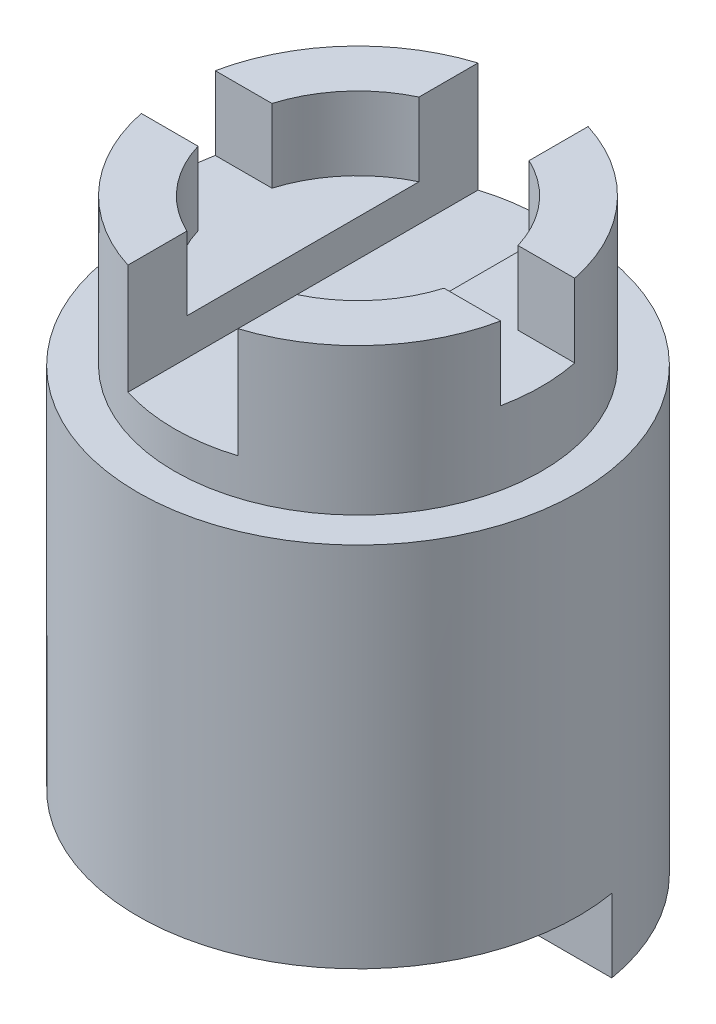
ISO-10303-21;
HEADER;
FILE_DESCRIPTION(('STEP AP214'),'2;1');
FILE_NAME('part.step','',(''),(''),'','','');
FILE_SCHEMA(('AUTOMOTIVE_DESIGN { 1 0 10303 214 1 1 1 1 }'));
ENDSEC;
DATA;
#1=APPLICATION_CONTEXT('core data for automotive mechanical design processes');
#2=APPLICATION_PROTOCOL_DEFINITION('international standard','automotive_design',2000,#1);
#3=PRODUCT_CONTEXT('',#1,'mechanical');
#4=PRODUCT('Part','Part','',(#3));
#5=PRODUCT_RELATED_PRODUCT_CATEGORY('part','',(#4));
#6=PRODUCT_DEFINITION_FORMATION('','',#4);
#7=PRODUCT_DEFINITION_CONTEXT('part definition',#1,'design');
#8=PRODUCT_DEFINITION('design','',#6,#7);
#9=PRODUCT_DEFINITION_SHAPE('','',#8);
#10=(LENGTH_UNIT() NAMED_UNIT(*) SI_UNIT(.MILLI.,.METRE.));
#11=(NAMED_UNIT(*) PLANE_ANGLE_UNIT() SI_UNIT($,.RADIAN.));
#12=(NAMED_UNIT(*) SI_UNIT($,.STERADIAN.) SOLID_ANGLE_UNIT());
#13=UNCERTAINTY_MEASURE_WITH_UNIT(LENGTH_MEASURE(1.E-05),#10,'distance_accuracy_value','');
#14=(GEOMETRIC_REPRESENTATION_CONTEXT(3) GLOBAL_UNCERTAINTY_ASSIGNED_CONTEXT((#13)) GLOBAL_UNIT_ASSIGNED_CONTEXT((#10,
#11,#12)) REPRESENTATION_CONTEXT('',''));
#15=CARTESIAN_POINT('',(0.,0.,0.));
#16=DIRECTION('',(0.,0.,1.));
#17=DIRECTION('',(1.,0.,0.));
#18=AXIS2_PLACEMENT_3D('',#15,#16,#17);
#19=CARTESIAN_POINT('',(0.,0.,0.));
#20=DIRECTION('',(0.,1.,0.));
#21=DIRECTION('',(0.,0.,1.));
#22=AXIS2_PLACEMENT_3D('',#19,#20,#21);
#23=PLANE('',#22);
#24=CARTESIAN_POINT('',(0.,0.,0.));
#25=DIRECTION('',(0.,1.,0.));
#26=DIRECTION('',(0.,0.,1.));
#27=AXIS2_PLACEMENT_3D('',#24,#25,#26);
#28=CIRCLE('',#27,19.05);
#29=CARTESIAN_POINT('',(18.7835533113413,0.,-3.175));
#30=VERTEX_POINT('',#29);
#31=CARTESIAN_POINT('',(3.2004,0.,-18.7792422594736));
#32=VERTEX_POINT('',#31);
#33=EDGE_CURVE('E244',#30,#32,#28,.T.);
#34=ORIENTED_EDGE('',*,*,#33,.F.);
#35=DIRECTION('',(1.,0.,0.));
#36=VECTOR('',#35,1.);
#37=CARTESIAN_POINT('',(-19.05,0.,-3.175));
#38=LINE('',#37,#36);
#39=CARTESIAN_POINT('',(8.98025612106915,0.,-3.175));
#40=VERTEX_POINT('',#39);
#41=EDGE_CURVE('E236',#40,#30,#38,.T.);
#42=ORIENTED_EDGE('',*,*,#41,.F.);
#43=CARTESIAN_POINT('',(0.,0.,0.));
#44=DIRECTION('',(0.,-1.,0.));
#45=DIRECTION('',(0.,0.,-1.));
#46=AXIS2_PLACEMENT_3D('',#43,#44,#45);
#47=CIRCLE('',#46,9.525);
#48=CARTESIAN_POINT('',(3.2004,0.,-8.97123541325274));
#49=VERTEX_POINT('',#48);
#50=EDGE_CURVE('E416',#49,#40,#47,.T.);
#51=ORIENTED_EDGE('',*,*,#50,.F.);
#52=DIRECTION('',(0.,0.,1.));
#53=VECTOR('',#52,1.);
#54=CARTESIAN_POINT('',(3.2004,0.,0.));
#55=LINE('',#54,#53);
#56=EDGE_CURVE('E440',#32,#49,#55,.T.);
#57=ORIENTED_EDGE('',*,*,#56,.F.);
#58=EDGE_LOOP('',(#34,#42,#51,#57));
#59=FACE_BOUND('',#58,.T.);
#60=ADVANCED_FACE('F55',(#59),#23,.F.);
#61=CARTESIAN_POINT('',(0.,6.35,0.));
#62=DIRECTION('',(0.,-1.,0.));
#63=DIRECTION('',(0.,0.,-1.));
#64=AXIS2_PLACEMENT_3D('',#61,#62,#63);
#65=CYLINDRICAL_SURFACE('',#64,9.525);
#66=ORIENTED_EDGE('',*,*,#50,.T.);
#67=DIRECTION('',(0.,-1.,0.));
#68=VECTOR('',#67,1.);
#69=CARTESIAN_POINT('',(8.98025612106915,6.35,-3.175));
#70=LINE('',#69,#68);
#71=CARTESIAN_POINT('',(8.98025612106915,6.35,-3.175));
#72=VERTEX_POINT('',#71);
#73=EDGE_CURVE('E225',#40,#72,#70,.F.);
#74=ORIENTED_EDGE('',*,*,#73,.T.);
#75=CARTESIAN_POINT('',(0.,6.35,0.));
#76=DIRECTION('',(0.,-1.,0.));
#77=DIRECTION('',(0.,0.,-1.));
#78=AXIS2_PLACEMENT_3D('',#75,#76,#77);
#79=CIRCLE('',#78,9.525);
#80=CARTESIAN_POINT('',(3.2004,6.35,-8.97123541325274));
#81=VERTEX_POINT('',#80);
#82=EDGE_CURVE('E407',#81,#72,#79,.T.);
#83=ORIENTED_EDGE('',*,*,#82,.F.);
#84=DIRECTION('',(0.,-1.,0.));
#85=VECTOR('',#84,1.);
#86=CARTESIAN_POINT('',(3.2004,6.35,-8.97123541325274));
#87=LINE('',#86,#85);
#88=EDGE_CURVE('E436',#81,#49,#87,.T.);
#89=ORIENTED_EDGE('',*,*,#88,.T.);
#90=EDGE_LOOP('',(#66,#74,#83,#89));
#91=FACE_BOUND('',#90,.T.);
#92=ADVANCED_FACE('F522',(#91),#65,.F.);
#93=CARTESIAN_POINT('',(0.,50.8,0.));
#94=DIRECTION('',(0.,1.,0.));
#95=DIRECTION('',(0.,0.,1.));
#96=AXIS2_PLACEMENT_3D('',#93,#94,#95);
#97=PLANE('',#96);
#98=DIRECTION('',(-1.,0.,0.));
#99=VECTOR('',#98,1.);
#100=CARTESIAN_POINT('',(-19.05,50.8,-3.2004));
#101=LINE('',#100,#99);
#102=CARTESIAN_POINT('',(-10.6416679186113,50.8,-3.2004));
#103=VERTEX_POINT('',#102);
#104=CARTESIAN_POINT('',(-15.5490535030271,50.8,-3.2004));
#105=VERTEX_POINT('',#104);
#106=EDGE_CURVE('E360',#103,#105,#101,.T.);
#107=ORIENTED_EDGE('',*,*,#106,.F.);
#108=CARTESIAN_POINT('',(0.,50.8,0.));
#109=DIRECTION('',(0.,1.,0.));
#110=DIRECTION('',(0.,0.,1.));
#111=AXIS2_PLACEMENT_3D('',#108,#109,#110);
#112=CIRCLE('',#111,11.1125);
#113=CARTESIAN_POINT('',(-4.7625,50.8,-10.0402315710346));
#114=VERTEX_POINT('',#113);
#115=EDGE_CURVE('E339',#114,#103,#112,.T.);
#116=ORIENTED_EDGE('',*,*,#115,.F.);
#117=DIRECTION('',(0.,0.,1.));
#118=VECTOR('',#117,1.);
#119=CARTESIAN_POINT('',(-4.76250000000001,50.8,-19.05));
#120=LINE('',#119,#118);
#121=CARTESIAN_POINT('',(-4.7625,50.8,-15.143784822494));
#122=VERTEX_POINT('',#121);
#123=EDGE_CURVE('E300',#122,#114,#120,.T.);
#124=ORIENTED_EDGE('',*,*,#123,.F.);
#125=CARTESIAN_POINT('',(0.,50.8,0.));
#126=DIRECTION('',(0.,1.,0.));
#127=DIRECTION('',(0.,0.,1.));
#128=AXIS2_PLACEMENT_3D('',#125,#126,#127);
#129=CIRCLE('',#128,15.875);
#130=EDGE_CURVE('E347',#122,#105,#129,.T.);
#131=ORIENTED_EDGE('',*,*,#130,.T.);
#132=EDGE_LOOP('',(#107,#116,#124,#131));
#133=FACE_BOUND('',#132,.T.);
#134=ADVANCED_FACE('F358',(#133),#97,.T.);
#135=CARTESIAN_POINT('',(0.,44.45,0.));
#136=DIRECTION('',(0.,1.,0.));
#137=DIRECTION('',(0.,0.,1.));
#138=AXIS2_PLACEMENT_3D('',#135,#136,#137);
#139=CYLINDRICAL_SURFACE('',#138,11.1125);
#140=ORIENTED_EDGE('',*,*,#115,.T.);
#141=DIRECTION('',(0.,1.,0.));
#142=VECTOR('',#141,1.);
#143=CARTESIAN_POINT('',(-10.6416679186113,44.45,-3.2004));
#144=LINE('',#143,#142);
#145=CARTESIAN_POINT('',(-10.6416679186113,44.45,-3.2004));
#146=VERTEX_POINT('',#145);
#147=EDGE_CURVE('E301',#103,#146,#144,.F.);
#148=ORIENTED_EDGE('',*,*,#147,.T.);
#149=CARTESIAN_POINT('',(0.,44.45,0.));
#150=DIRECTION('',(0.,1.,0.));
#151=DIRECTION('',(0.,0.,1.));
#152=AXIS2_PLACEMENT_3D('',#149,#150,#151);
#153=CIRCLE('',#152,11.1125);
#154=CARTESIAN_POINT('',(-4.7625,44.45,-10.0402315710346));
#155=VERTEX_POINT('',#154);
#156=EDGE_CURVE('E333',#155,#146,#153,.T.);
#157=ORIENTED_EDGE('',*,*,#156,.F.);
#158=DIRECTION('',(0.,1.,0.));
#159=VECTOR('',#158,1.);
#160=CARTESIAN_POINT('',(-4.7625,44.45,-10.0402315710346));
#161=LINE('',#160,#159);
#162=EDGE_CURVE('E312',#155,#114,#161,.T.);
#163=ORIENTED_EDGE('',*,*,#162,.T.);
#164=EDGE_LOOP('',(#140,#148,#157,#163));
#165=FACE_BOUND('',#164,.T.);
#166=ADVANCED_FACE('F560',(#165),#139,.F.);
#167=CARTESIAN_POINT('',(15.5490535030271,50.8,-3.2004));
#168=VERTEX_POINT('',#167);
#169=CARTESIAN_POINT('',(10.6416679186113,50.8,-3.2004));
#170=VERTEX_POINT('',#169);
#171=EDGE_CURVE('E402',#168,#170,#101,.T.);
#172=ORIENTED_EDGE('',*,*,#171,.F.);
#173=CARTESIAN_POINT('',(4.7625,50.8,-15.143784822494));
#174=VERTEX_POINT('',#173);
#175=EDGE_CURVE('E346',#168,#174,#129,.T.);
#176=ORIENTED_EDGE('',*,*,#175,.T.);
#177=DIRECTION('',(0.,0.,-1.));
#178=VECTOR('',#177,1.);
#179=CARTESIAN_POINT('',(4.76250000000001,50.8,-19.05));
#180=LINE('',#179,#178);
#181=CARTESIAN_POINT('',(4.7625,50.8,-10.0402315710346));
#182=VERTEX_POINT('',#181);
#183=EDGE_CURVE('E302',#182,#174,#180,.T.);
#184=ORIENTED_EDGE('',*,*,#183,.F.);
#185=EDGE_CURVE('E338',#170,#182,#112,.T.);
#186=ORIENTED_EDGE('',*,*,#185,.F.);
#187=EDGE_LOOP('',(#172,#176,#184,#186));
#188=FACE_BOUND('',#187,.T.);
#189=ADVANCED_FACE('F566',(#188),#97,.T.);
#190=CARTESIAN_POINT('',(10.6416679186113,44.45,-3.2004));
#191=VERTEX_POINT('',#190);
#192=CARTESIAN_POINT('',(4.7625,44.45,-10.0402315710346));
#193=VERTEX_POINT('',#192);
#194=EDGE_CURVE('E331',#191,#193,#153,.T.);
#195=ORIENTED_EDGE('',*,*,#194,.F.);
#196=DIRECTION('',(0.,1.,0.));
#197=VECTOR('',#196,1.);
#198=CARTESIAN_POINT('',(10.6416679186113,44.45,-3.2004));
#199=LINE('',#198,#197);
#200=EDGE_CURVE('E375',#191,#170,#199,.T.);
#201=ORIENTED_EDGE('',*,*,#200,.T.);
#202=ORIENTED_EDGE('',*,*,#185,.T.);
#203=DIRECTION('',(0.,1.,0.));
#204=VECTOR('',#203,1.);
#205=CARTESIAN_POINT('',(4.7625,44.45,-10.0402315710346));
#206=LINE('',#205,#204);
#207=EDGE_CURVE('E290',#182,#193,#206,.F.);
#208=ORIENTED_EDGE('',*,*,#207,.T.);
#209=EDGE_LOOP('',(#195,#201,#202,#208));
#210=FACE_BOUND('',#209,.T.);
#211=ADVANCED_FACE('F489',(#210),#139,.F.);
#212=DIRECTION('',(1.,0.,0.));
#213=VECTOR('',#212,1.);
#214=CARTESIAN_POINT('',(-19.05,50.8,3.2004));
#215=LINE('',#214,#213);
#216=CARTESIAN_POINT('',(-15.5490535030271,50.8,3.2004));
#217=VERTEX_POINT('',#216);
#218=CARTESIAN_POINT('',(-10.6416679186113,50.8,3.2004));
#219=VERTEX_POINT('',#218);
#220=EDGE_CURVE('E403',#217,#219,#215,.T.);
#221=ORIENTED_EDGE('',*,*,#220,.F.);
#222=CARTESIAN_POINT('',(-4.7625,50.8,15.143784822494));
#223=VERTEX_POINT('',#222);
#224=EDGE_CURVE('E330',#217,#223,#129,.T.);
#225=ORIENTED_EDGE('',*,*,#224,.T.);
#226=CARTESIAN_POINT('',(-4.7625,50.8,10.0402315710346));
#227=VERTEX_POINT('',#226);
#228=EDGE_CURVE('E296',#227,#223,#120,.T.);
#229=ORIENTED_EDGE('',*,*,#228,.F.);
#230=EDGE_CURVE('E325',#219,#227,#112,.T.);
#231=ORIENTED_EDGE('',*,*,#230,.F.);
#232=EDGE_LOOP('',(#221,#225,#229,#231));
#233=FACE_BOUND('',#232,.T.);
#234=ADVANCED_FACE('F507',(#233),#97,.T.);
#235=CARTESIAN_POINT('',(-10.6416679186113,44.45,3.2004));
#236=VERTEX_POINT('',#235);
#237=CARTESIAN_POINT('',(-4.7625,44.45,10.0402315710346));
#238=VERTEX_POINT('',#237);
#239=EDGE_CURVE('E332',#236,#238,#153,.T.);
#240=ORIENTED_EDGE('',*,*,#239,.F.);
#241=DIRECTION('',(0.,1.,0.));
#242=VECTOR('',#241,1.);
#243=CARTESIAN_POINT('',(-10.6416679186113,44.45,3.2004));
#244=LINE('',#243,#242);
#245=EDGE_CURVE('E381',#236,#219,#244,.T.);
#246=ORIENTED_EDGE('',*,*,#245,.T.);
#247=ORIENTED_EDGE('',*,*,#230,.T.);
#248=DIRECTION('',(0.,1.,0.));
#249=VECTOR('',#248,1.);
#250=CARTESIAN_POINT('',(-4.7625,44.45,10.0402315710346));
#251=LINE('',#250,#249);
#252=EDGE_CURVE('E316',#227,#238,#251,.F.);
#253=ORIENTED_EDGE('',*,*,#252,.T.);
#254=EDGE_LOOP('',(#240,#246,#247,#253));
#255=FACE_BOUND('',#254,.T.);
#256=ADVANCED_FACE('F501',(#255),#139,.F.);
#257=CARTESIAN_POINT('',(0.,44.45,0.));
#258=DIRECTION('',(0.,1.,0.));
#259=DIRECTION('',(0.,0.,1.));
#260=AXIS2_PLACEMENT_3D('',#257,#258,#259);
#261=PLANE('',#260);
#262=ORIENTED_EDGE('',*,*,#239,.T.);
#263=DIRECTION('',(0.,0.,1.));
#264=VECTOR('',#263,1.);
#265=CARTESIAN_POINT('',(-4.7625,44.45,0.));
#266=LINE('',#265,#264);
#267=EDGE_CURVE('E248',#155,#238,#266,.T.);
#268=ORIENTED_EDGE('',*,*,#267,.F.);
#269=ORIENTED_EDGE('',*,*,#156,.T.);
#270=DIRECTION('',(-1.,0.,0.));
#271=VECTOR('',#270,1.);
#272=CARTESIAN_POINT('',(-19.05,44.45,-3.2004));
#273=LINE('',#272,#271);
#274=CARTESIAN_POINT('',(-15.5490535030271,44.45,-3.2004));
#275=VERTEX_POINT('',#274);
#276=EDGE_CURVE('E408',#146,#275,#273,.T.);
#277=ORIENTED_EDGE('',*,*,#276,.T.);
#278=CARTESIAN_POINT('',(0.,44.45,0.));
#279=DIRECTION('',(0.,1.,0.));
#280=DIRECTION('',(0.,0.,1.));
#281=AXIS2_PLACEMENT_3D('',#278,#279,#280);
#282=CIRCLE('',#281,15.875);
#283=CARTESIAN_POINT('',(-15.5490535030271,44.45,3.2004));
#284=VERTEX_POINT('',#283);
#285=EDGE_CURVE('E367',#284,#275,#282,.F.);
#286=ORIENTED_EDGE('',*,*,#285,.F.);
#287=DIRECTION('',(1.,0.,0.));
#288=VECTOR('',#287,1.);
#289=CARTESIAN_POINT('',(-19.05,44.45,3.2004));
#290=LINE('',#289,#288);
#291=EDGE_CURVE('E411',#284,#236,#290,.T.);
#292=ORIENTED_EDGE('',*,*,#291,.T.);
#293=EDGE_LOOP('',(#262,#268,#269,#277,#286,#292));
#294=FACE_BOUND('',#293,.T.);
#295=ADVANCED_FACE('F497',(#294),#261,.T.);
#296=CARTESIAN_POINT('',(0.,50.8,0.));
#297=DIRECTION('',(0.,-1.,0.));
#298=DIRECTION('',(0.,0.,-1.));
#299=AXIS2_PLACEMENT_3D('',#296,#297,#298);
#300=CYLINDRICAL_SURFACE('',#299,19.05);
#301=CARTESIAN_POINT('',(0.,6.35,0.));
#302=DIRECTION('',(0.,1.,0.));
#303=DIRECTION('',(0.,0.,1.));
#304=AXIS2_PLACEMENT_3D('',#301,#302,#303);
#305=CIRCLE('',#304,19.05);
#306=CARTESIAN_POINT('',(-18.7835533113413,6.35,-3.175));
#307=VERTEX_POINT('',#306);
#308=CARTESIAN_POINT('',(18.7835533113413,6.35,-3.175));
#309=VERTEX_POINT('',#308);
#310=EDGE_CURVE('E447',#307,#309,#305,.T.);
#311=ORIENTED_EDGE('',*,*,#310,.T.);
#312=DIRECTION('',(0.,-1.,0.));
#313=VECTOR('',#312,1.);
#314=CARTESIAN_POINT('',(18.7835533113413,50.8,-3.175));
#315=LINE('',#314,#313);
#316=EDGE_CURVE('E224',#309,#30,#315,.T.);
#317=ORIENTED_EDGE('',*,*,#316,.T.);
#318=ORIENTED_EDGE('',*,*,#33,.T.);
#319=DIRECTION('',(0.,-1.,0.));
#320=VECTOR('',#319,1.);
#321=CARTESIAN_POINT('',(3.2004,50.8,-18.7792422594736));
#322=LINE('',#321,#320);
#323=CARTESIAN_POINT('',(3.2004,6.35,-18.7792422594736));
#324=VERTEX_POINT('',#323);
#325=EDGE_CURVE('E432',#32,#324,#322,.F.);
#326=ORIENTED_EDGE('',*,*,#325,.T.);
#327=CARTESIAN_POINT('',(0.,6.35,0.));
#328=DIRECTION('',(0.,-1.,0.));
#329=DIRECTION('',(0.,0.,-1.));
#330=AXIS2_PLACEMENT_3D('',#327,#328,#329);
#331=CIRCLE('',#330,19.05);
#332=CARTESIAN_POINT('',(-3.20039999999999,6.35,-18.7792422594736));
#333=VERTEX_POINT('',#332);
#334=EDGE_CURVE('E423',#333,#324,#331,.T.);
#335=ORIENTED_EDGE('',*,*,#334,.F.);
#336=DIRECTION('',(0.,-1.,0.));
#337=VECTOR('',#336,1.);
#338=CARTESIAN_POINT('',(-3.2004,50.8,-18.7792422594736));
#339=LINE('',#338,#337);
#340=CARTESIAN_POINT('',(-3.2004,0.,-18.7792422594736));
#341=VERTEX_POINT('',#340);
#342=EDGE_CURVE('E241',#333,#341,#339,.T.);
#343=ORIENTED_EDGE('',*,*,#342,.T.);
#344=CARTESIAN_POINT('',(-18.7835533113413,0.,-3.175));
#345=VERTEX_POINT('',#344);
#346=EDGE_CURVE('E232',#341,#345,#28,.T.);
#347=ORIENTED_EDGE('',*,*,#346,.T.);
#348=DIRECTION('',(0.,-1.,0.));
#349=VECTOR('',#348,1.);
#350=CARTESIAN_POINT('',(-18.7835533113413,50.8,-3.175));
#351=LINE('',#350,#349);
#352=EDGE_CURVE('E216',#345,#307,#351,.F.);
#353=ORIENTED_EDGE('',*,*,#352,.T.);
#354=EDGE_LOOP('',(#311,#317,#318,#326,#335,#343,#347,#353));
#355=FACE_BOUND('',#354,.T.);
#356=CARTESIAN_POINT('',(0.,38.1,0.));
#357=DIRECTION('',(0.,1.,0.));
#358=DIRECTION('',(0.,0.,1.));
#359=AXIS2_PLACEMENT_3D('',#356,#357,#358);
#360=CIRCLE('',#359,19.05);
#361=CARTESIAN_POINT('',(0.,38.1,19.05));
#362=VERTEX_POINT('',#361);
#363=EDGE_CURVE('E250',#362,#362,#360,.T.);
#364=ORIENTED_EDGE('',*,*,#363,.F.);
#365=EDGE_LOOP('',(#364));
#366=FACE_BOUND('',#365,.T.);
#367=ADVANCED_FACE('F57',(#355,#366),#300,.T.);
#368=CARTESIAN_POINT('',(-8.98025612106915,0.,-3.175));
#369=VERTEX_POINT('',#368);
#370=CARTESIAN_POINT('',(-3.2004,0.,-8.97123541325274));
#371=VERTEX_POINT('',#370);
#372=EDGE_CURVE('E233',#369,#371,#47,.T.);
#373=ORIENTED_EDGE('',*,*,#372,.F.);
#374=EDGE_CURVE('E219',#345,#369,#38,.T.);
#375=ORIENTED_EDGE('',*,*,#374,.F.);
#376=ORIENTED_EDGE('',*,*,#346,.F.);
#377=DIRECTION('',(0.,0.,-1.));
#378=VECTOR('',#377,1.);
#379=CARTESIAN_POINT('',(-3.2004,0.,0.));
#380=LINE('',#379,#378);
#381=EDGE_CURVE('E444',#371,#341,#380,.T.);
#382=ORIENTED_EDGE('',*,*,#381,.F.);
#383=EDGE_LOOP('',(#373,#375,#376,#382));
#384=FACE_BOUND('',#383,.T.);
#385=ADVANCED_FACE('F230',(#384),#23,.F.);
#386=CARTESIAN_POINT('',(0.,38.1,0.));
#387=DIRECTION('',(0.,1.,0.));
#388=DIRECTION('',(0.,0.,1.));
#389=AXIS2_PLACEMENT_3D('',#386,#387,#388);
#390=PLANE('',#389);
#391=CARTESIAN_POINT('',(0.,38.1,0.));
#392=DIRECTION('',(0.,1.,0.));
#393=DIRECTION('',(0.,0.,1.));
#394=AXIS2_PLACEMENT_3D('',#391,#392,#393);
#395=CIRCLE('',#394,15.875);
#396=CARTESIAN_POINT('',(0.,38.1,15.875));
#397=VERTEX_POINT('',#396);
#398=EDGE_CURVE('E340',#397,#397,#395,.T.);
#399=ORIENTED_EDGE('',*,*,#398,.F.);
#400=EDGE_LOOP('',(#399));
#401=FACE_BOUND('',#400,.T.);
#402=ORIENTED_EDGE('',*,*,#363,.T.);
#403=EDGE_LOOP('',(#402));
#404=FACE_BOUND('',#403,.T.);
#405=ADVANCED_FACE('F536',(#401,#404),#390,.T.);
#406=CARTESIAN_POINT('',(0.,38.1,0.));
#407=DIRECTION('',(0.,1.,0.));
#408=DIRECTION('',(0.,0.,1.));
#409=AXIS2_PLACEMENT_3D('',#406,#407,#408);
#410=CYLINDRICAL_SURFACE('',#409,15.875);
#411=DIRECTION('',(0.,1.,0.));
#412=VECTOR('',#411,1.);
#413=CARTESIAN_POINT('',(-15.5490535030271,38.1,-3.2004));
#414=LINE('',#413,#412);
#415=EDGE_CURVE('E365',#105,#275,#414,.F.);
#416=ORIENTED_EDGE('',*,*,#415,.F.);
#417=ORIENTED_EDGE('',*,*,#130,.F.);
#418=DIRECTION('',(0.,1.,0.));
#419=VECTOR('',#418,1.);
#420=CARTESIAN_POINT('',(-4.7625,38.1,-15.143784822494));
#421=LINE('',#420,#419);
#422=CARTESIAN_POINT('',(-4.7625,41.275,-15.143784822494));
#423=VERTEX_POINT('',#422);
#424=EDGE_CURVE('E320',#423,#122,#421,.T.);
#425=ORIENTED_EDGE('',*,*,#424,.F.);
#426=CARTESIAN_POINT('',(0.,41.275,0.));
#427=DIRECTION('',(0.,1.,0.));
#428=DIRECTION('',(0.,0.,1.));
#429=AXIS2_PLACEMENT_3D('',#426,#427,#428);
#430=CIRCLE('',#429,15.875);
#431=CARTESIAN_POINT('',(4.7625,41.275,-15.143784822494));
#432=VERTEX_POINT('',#431);
#433=EDGE_CURVE('E13',#423,#432,#430,.F.);
#434=ORIENTED_EDGE('',*,*,#433,.T.);
#435=DIRECTION('',(0.,1.,0.));
#436=VECTOR('',#435,1.);
#437=CARTESIAN_POINT('',(4.7625,38.1,-15.143784822494));
#438=LINE('',#437,#436);
#439=EDGE_CURVE('E283',#174,#432,#438,.F.);
#440=ORIENTED_EDGE('',*,*,#439,.F.);
#441=ORIENTED_EDGE('',*,*,#175,.F.);
#442=DIRECTION('',(0.,1.,0.));
#443=VECTOR('',#442,1.);
#444=CARTESIAN_POINT('',(15.5490535030271,38.1,-3.2004));
#445=LINE('',#444,#443);
#446=CARTESIAN_POINT('',(15.5490535030271,44.45,-3.2004));
#447=VERTEX_POINT('',#446);
#448=EDGE_CURVE('E370',#447,#168,#445,.T.);
#449=ORIENTED_EDGE('',*,*,#448,.F.);
#450=CARTESIAN_POINT('',(15.5490535030271,44.45,3.2004));
#451=VERTEX_POINT('',#450);
#452=EDGE_CURVE('E395',#447,#451,#282,.F.);
#453=ORIENTED_EDGE('',*,*,#452,.T.);
#454=DIRECTION('',(0.,1.,0.));
#455=VECTOR('',#454,1.);
#456=CARTESIAN_POINT('',(15.5490535030271,38.1,3.2004));
#457=LINE('',#456,#455);
#458=CARTESIAN_POINT('',(15.5490535030271,50.8,3.2004));
#459=VERTEX_POINT('',#458);
#460=EDGE_CURVE('E385',#459,#451,#457,.F.);
#461=ORIENTED_EDGE('',*,*,#460,.F.);
#462=CARTESIAN_POINT('',(4.7625,50.8,15.143784822494));
#463=VERTEX_POINT('',#462);
#464=EDGE_CURVE('E343',#463,#459,#129,.T.);
#465=ORIENTED_EDGE('',*,*,#464,.F.);
#466=DIRECTION('',(0.,1.,0.));
#467=VECTOR('',#466,1.);
#468=CARTESIAN_POINT('',(4.7625,38.1,15.143784822494));
#469=LINE('',#468,#467);
#470=CARTESIAN_POINT('',(4.7625,41.275,15.143784822494));
#471=VERTEX_POINT('',#470);
#472=EDGE_CURVE('E269',#471,#463,#469,.T.);
#473=ORIENTED_EDGE('',*,*,#472,.F.);
#474=CARTESIAN_POINT('',(-4.7625,41.275,15.143784822494));
#475=VERTEX_POINT('',#474);
#476=EDGE_CURVE('E59',#471,#475,#430,.F.);
#477=ORIENTED_EDGE('',*,*,#476,.T.);
#478=DIRECTION('',(0.,1.,0.));
#479=VECTOR('',#478,1.);
#480=CARTESIAN_POINT('',(-4.7625,38.1,15.143784822494));
#481=LINE('',#480,#479);
#482=EDGE_CURVE('E267',#223,#475,#481,.F.);
#483=ORIENTED_EDGE('',*,*,#482,.F.);
#484=ORIENTED_EDGE('',*,*,#224,.F.);
#485=DIRECTION('',(0.,1.,0.));
#486=VECTOR('',#485,1.);
#487=CARTESIAN_POINT('',(-15.5490535030271,38.1,3.2004));
#488=LINE('',#487,#486);
#489=EDGE_CURVE('E388',#284,#217,#488,.T.);
#490=ORIENTED_EDGE('',*,*,#489,.F.);
#491=ORIENTED_EDGE('',*,*,#285,.T.);
#492=EDGE_LOOP('',(#416,#417,#425,#434,#440,#441,#449,#453,#461,#465,#473,#477,#483,#484,#490,#491));
#493=FACE_BOUND('',#492,.T.);
#494=ORIENTED_EDGE('',*,*,#398,.T.);
#495=EDGE_LOOP('',(#494));
#496=FACE_BOUND('',#495,.T.);
#497=ADVANCED_FACE('F264',(#493,#496),#410,.T.);
#498=CARTESIAN_POINT('',(10.6416679186113,50.8,3.2004));
#499=VERTEX_POINT('',#498);
#500=EDGE_CURVE('E404',#499,#459,#215,.T.);
#501=ORIENTED_EDGE('',*,*,#500,.F.);
#502=CARTESIAN_POINT('',(4.7625,50.8,10.0402315710346));
#503=VERTEX_POINT('',#502);
#504=EDGE_CURVE('E334',#503,#499,#112,.T.);
#505=ORIENTED_EDGE('',*,*,#504,.F.);
#506=EDGE_CURVE('E292',#463,#503,#180,.T.);
#507=ORIENTED_EDGE('',*,*,#506,.F.);
#508=ORIENTED_EDGE('',*,*,#464,.T.);
#509=EDGE_LOOP('',(#501,#505,#507,#508));
#510=FACE_BOUND('',#509,.T.);
#511=ADVANCED_FACE('F558',(#510),#97,.T.);
#512=ORIENTED_EDGE('',*,*,#504,.T.);
#513=DIRECTION('',(0.,1.,0.));
#514=VECTOR('',#513,1.);
#515=CARTESIAN_POINT('',(10.6416679186113,44.45,3.2004));
#516=LINE('',#515,#514);
#517=CARTESIAN_POINT('',(10.6416679186112,44.45,3.2004));
#518=VERTEX_POINT('',#517);
#519=EDGE_CURVE('E391',#499,#518,#516,.F.);
#520=ORIENTED_EDGE('',*,*,#519,.T.);
#521=CARTESIAN_POINT('',(4.7625,44.45,10.0402315710346));
#522=VERTEX_POINT('',#521);
#523=EDGE_CURVE('E326',#522,#518,#153,.T.);
#524=ORIENTED_EDGE('',*,*,#523,.F.);
#525=DIRECTION('',(0.,1.,0.));
#526=VECTOR('',#525,1.);
#527=CARTESIAN_POINT('',(4.7625,44.45,10.0402315710346));
#528=LINE('',#527,#526);
#529=EDGE_CURVE('E285',#522,#503,#528,.T.);
#530=ORIENTED_EDGE('',*,*,#529,.T.);
#531=EDGE_LOOP('',(#512,#520,#524,#530));
#532=FACE_BOUND('',#531,.T.);
#533=ADVANCED_FACE('F551',(#532),#139,.F.);
#534=ORIENTED_EDGE('',*,*,#523,.T.);
#535=EDGE_CURVE('E412',#518,#451,#290,.T.);
#536=ORIENTED_EDGE('',*,*,#535,.T.);
#537=ORIENTED_EDGE('',*,*,#452,.F.);
#538=EDGE_CURVE('E399',#447,#191,#273,.T.);
#539=ORIENTED_EDGE('',*,*,#538,.T.);
#540=ORIENTED_EDGE('',*,*,#194,.T.);
#541=DIRECTION('',(0.,0.,-1.));
#542=VECTOR('',#541,1.);
#543=CARTESIAN_POINT('',(4.7625,44.45,0.));
#544=LINE('',#543,#542);
#545=EDGE_CURVE('E243',#522,#193,#544,.T.);
#546=ORIENTED_EDGE('',*,*,#545,.F.);
#547=EDGE_LOOP('',(#534,#536,#537,#539,#540,#546));
#548=FACE_BOUND('',#547,.T.);
#549=ADVANCED_FACE('F480',(#548),#261,.T.);
#550=CARTESIAN_POINT('',(-4.76250000000001,41.275,-19.05));
#551=DIRECTION('',(-1.,0.,0.));
#552=DIRECTION('',(0.,0.,1.));
#553=AXIS2_PLACEMENT_3D('',#550,#551,#552);
#554=PLANE('',#553);
#555=ORIENTED_EDGE('',*,*,#482,.T.);
#556=DIRECTION('',(0.,0.,1.));
#557=VECTOR('',#556,1.);
#558=CARTESIAN_POINT('',(-4.76250000000001,41.275,-19.05));
#559=LINE('',#558,#557);
#560=EDGE_CURVE('E277',#423,#475,#559,.T.);
#561=ORIENTED_EDGE('',*,*,#560,.F.);
#562=ORIENTED_EDGE('',*,*,#424,.T.);
#563=ORIENTED_EDGE('',*,*,#123,.T.);
#564=ORIENTED_EDGE('',*,*,#162,.F.);
#565=ORIENTED_EDGE('',*,*,#267,.T.);
#566=ORIENTED_EDGE('',*,*,#252,.F.);
#567=ORIENTED_EDGE('',*,*,#228,.T.);
#568=EDGE_LOOP('',(#555,#561,#562,#563,#564,#565,#566,#567));
#569=FACE_BOUND('',#568,.T.);
#570=ADVANCED_FACE('F504',(#569),#554,.F.);
#571=CARTESIAN_POINT('',(4.76250000000001,41.275,-19.05));
#572=DIRECTION('',(1.,0.,0.));
#573=DIRECTION('',(0.,0.,-1.));
#574=AXIS2_PLACEMENT_3D('',#571,#572,#573);
#575=PLANE('',#574);
#576=ORIENTED_EDGE('',*,*,#439,.T.);
#577=DIRECTION('',(0.,0.,-1.));
#578=VECTOR('',#577,1.);
#579=CARTESIAN_POINT('',(4.76250000000001,41.275,-19.05));
#580=LINE('',#579,#578);
#581=EDGE_CURVE('E275',#471,#432,#580,.T.);
#582=ORIENTED_EDGE('',*,*,#581,.F.);
#583=ORIENTED_EDGE('',*,*,#472,.T.);
#584=ORIENTED_EDGE('',*,*,#506,.T.);
#585=ORIENTED_EDGE('',*,*,#529,.F.);
#586=ORIENTED_EDGE('',*,*,#545,.T.);
#587=ORIENTED_EDGE('',*,*,#207,.F.);
#588=ORIENTED_EDGE('',*,*,#183,.T.);
#589=EDGE_LOOP('',(#576,#582,#583,#584,#585,#586,#587,#588));
#590=FACE_BOUND('',#589,.T.);
#591=ADVANCED_FACE('F279',(#590),#575,.F.);
#592=CARTESIAN_POINT('',(0.,41.275,0.));
#593=DIRECTION('',(0.,1.,0.));
#594=DIRECTION('',(0.,0.,1.));
#595=AXIS2_PLACEMENT_3D('',#592,#593,#594);
#596=PLANE('',#595);
#597=ORIENTED_EDGE('',*,*,#560,.T.);
#598=ORIENTED_EDGE('',*,*,#476,.F.);
#599=ORIENTED_EDGE('',*,*,#581,.T.);
#600=ORIENTED_EDGE('',*,*,#433,.F.);
#601=EDGE_LOOP('',(#597,#598,#599,#600));
#602=FACE_BOUND('',#601,.T.);
#603=ADVANCED_FACE('F274',(#602),#596,.T.);
#604=CARTESIAN_POINT('',(-19.05,44.45,3.2004));
#605=DIRECTION('',(0.,0.,1.));
#606=DIRECTION('',(1.,0.,0.));
#607=AXIS2_PLACEMENT_3D('',#604,#605,#606);
#608=PLANE('',#607);
#609=ORIENTED_EDGE('',*,*,#460,.T.);
#610=ORIENTED_EDGE('',*,*,#535,.F.);
#611=ORIENTED_EDGE('',*,*,#519,.F.);
#612=ORIENTED_EDGE('',*,*,#500,.T.);
#613=EDGE_LOOP('',(#609,#610,#611,#612));
#614=FACE_BOUND('',#613,.T.);
#615=ADVANCED_FACE('F514',(#614),#608,.F.);
#616=CARTESIAN_POINT('',(-19.05,44.45,-3.2004));
#617=DIRECTION('',(0.,0.,-1.));
#618=DIRECTION('',(-1.,0.,0.));
#619=AXIS2_PLACEMENT_3D('',#616,#617,#618);
#620=PLANE('',#619);
#621=ORIENTED_EDGE('',*,*,#448,.T.);
#622=ORIENTED_EDGE('',*,*,#171,.T.);
#623=ORIENTED_EDGE('',*,*,#200,.F.);
#624=ORIENTED_EDGE('',*,*,#538,.F.);
#625=EDGE_LOOP('',(#621,#622,#623,#624));
#626=FACE_BOUND('',#625,.T.);
#627=ADVANCED_FACE('F485',(#626),#620,.F.);
#628=ORIENTED_EDGE('',*,*,#106,.T.);
#629=ORIENTED_EDGE('',*,*,#415,.T.);
#630=ORIENTED_EDGE('',*,*,#276,.F.);
#631=ORIENTED_EDGE('',*,*,#147,.F.);
#632=EDGE_LOOP('',(#628,#629,#630,#631));
#633=FACE_BOUND('',#632,.T.);
#634=ADVANCED_FACE('F512',(#633),#620,.F.);
#635=ORIENTED_EDGE('',*,*,#291,.F.);
#636=ORIENTED_EDGE('',*,*,#489,.T.);
#637=ORIENTED_EDGE('',*,*,#220,.T.);
#638=ORIENTED_EDGE('',*,*,#245,.F.);
#639=EDGE_LOOP('',(#635,#636,#637,#638));
#640=FACE_BOUND('',#639,.T.);
#641=ADVANCED_FACE('F509',(#640),#608,.F.);
#642=CARTESIAN_POINT('',(-8.98025612106915,6.35,-3.175));
#643=VERTEX_POINT('',#642);
#644=CARTESIAN_POINT('',(-3.2004,6.35,-8.97123541325273));
#645=VERTEX_POINT('',#644);
#646=EDGE_CURVE('E420',#643,#645,#79,.T.);
#647=ORIENTED_EDGE('',*,*,#646,.F.);
#648=DIRECTION('',(0.,-1.,0.));
#649=VECTOR('',#648,1.);
#650=CARTESIAN_POINT('',(-8.98025612106915,6.35,-3.175));
#651=LINE('',#650,#649);
#652=EDGE_CURVE('E461',#643,#369,#651,.T.);
#653=ORIENTED_EDGE('',*,*,#652,.T.);
#654=ORIENTED_EDGE('',*,*,#372,.T.);
#655=DIRECTION('',(0.,-1.,0.));
#656=VECTOR('',#655,1.);
#657=CARTESIAN_POINT('',(-3.2004,6.35,-8.97123541325274));
#658=LINE('',#657,#656);
#659=EDGE_CURVE('E428',#371,#645,#658,.F.);
#660=ORIENTED_EDGE('',*,*,#659,.T.);
#661=EDGE_LOOP('',(#647,#653,#654,#660));
#662=FACE_BOUND('',#661,.T.);
#663=ADVANCED_FACE('F511',(#662),#65,.F.);
#664=CARTESIAN_POINT('',(0.,6.35,0.));
#665=DIRECTION('',(0.,-1.,0.));
#666=DIRECTION('',(0.,0.,-1.));
#667=AXIS2_PLACEMENT_3D('',#664,#665,#666);
#668=PLANE('',#667);
#669=ORIENTED_EDGE('',*,*,#82,.T.);
#670=DIRECTION('',(1.,0.,0.));
#671=VECTOR('',#670,1.);
#672=CARTESIAN_POINT('',(-19.05,6.35,-3.175));
#673=LINE('',#672,#671);
#674=EDGE_CURVE('E235',#72,#309,#673,.T.);
#675=ORIENTED_EDGE('',*,*,#674,.T.);
#676=ORIENTED_EDGE('',*,*,#310,.F.);
#677=EDGE_CURVE('E71',#307,#643,#673,.T.);
#678=ORIENTED_EDGE('',*,*,#677,.T.);
#679=ORIENTED_EDGE('',*,*,#646,.T.);
#680=DIRECTION('',(0.,0.,-1.));
#681=VECTOR('',#680,1.);
#682=CARTESIAN_POINT('',(-3.2004,6.35,0.));
#683=LINE('',#682,#681);
#684=EDGE_CURVE('E443',#645,#333,#683,.T.);
#685=ORIENTED_EDGE('',*,*,#684,.T.);
#686=ORIENTED_EDGE('',*,*,#334,.T.);
#687=DIRECTION('',(0.,0.,1.));
#688=VECTOR('',#687,1.);
#689=CARTESIAN_POINT('',(3.2004,6.35,0.));
#690=LINE('',#689,#688);
#691=EDGE_CURVE('E78',#324,#81,#690,.T.);
#692=ORIENTED_EDGE('',*,*,#691,.T.);
#693=EDGE_LOOP('',(#669,#675,#676,#678,#679,#685,#686,#692));
#694=FACE_BOUND('',#693,.T.);
#695=ADVANCED_FACE('F519',(#694),#668,.T.);
#696=CARTESIAN_POINT('',(-3.2004,6.35,0.));
#697=DIRECTION('',(-1.,0.,0.));
#698=DIRECTION('',(0.,0.,1.));
#699=AXIS2_PLACEMENT_3D('',#696,#697,#698);
#700=PLANE('',#699);
#701=ORIENTED_EDGE('',*,*,#684,.F.);
#702=ORIENTED_EDGE('',*,*,#659,.F.);
#703=ORIENTED_EDGE('',*,*,#381,.T.);
#704=ORIENTED_EDGE('',*,*,#342,.F.);
#705=EDGE_LOOP('',(#701,#702,#703,#704));
#706=FACE_BOUND('',#705,.T.);
#707=ADVANCED_FACE('F646',(#706),#700,.F.);
#708=CARTESIAN_POINT('',(3.2004,6.35,0.));
#709=DIRECTION('',(1.,0.,0.));
#710=DIRECTION('',(0.,0.,-1.));
#711=AXIS2_PLACEMENT_3D('',#708,#709,#710);
#712=PLANE('',#711);
#713=ORIENTED_EDGE('',*,*,#56,.T.);
#714=ORIENTED_EDGE('',*,*,#88,.F.);
#715=ORIENTED_EDGE('',*,*,#691,.F.);
#716=ORIENTED_EDGE('',*,*,#325,.F.);
#717=EDGE_LOOP('',(#713,#714,#715,#716));
#718=FACE_BOUND('',#717,.T.);
#719=ADVANCED_FACE('F651',(#718),#712,.F.);
#720=CARTESIAN_POINT('',(-19.05,6.35,-3.175));
#721=DIRECTION('',(0.,0.,-1.));
#722=DIRECTION('',(-1.,0.,0.));
#723=AXIS2_PLACEMENT_3D('',#720,#721,#722);
#724=PLANE('',#723);
#725=ORIENTED_EDGE('',*,*,#674,.F.);
#726=ORIENTED_EDGE('',*,*,#73,.F.);
#727=ORIENTED_EDGE('',*,*,#41,.T.);
#728=ORIENTED_EDGE('',*,*,#316,.F.);
#729=EDGE_LOOP('',(#725,#726,#727,#728));
#730=FACE_BOUND('',#729,.T.);
#731=ADVANCED_FACE('F662',(#730),#724,.F.);
#732=ORIENTED_EDGE('',*,*,#374,.T.);
#733=ORIENTED_EDGE('',*,*,#652,.F.);
#734=ORIENTED_EDGE('',*,*,#677,.F.);
#735=ORIENTED_EDGE('',*,*,#352,.F.);
#736=EDGE_LOOP('',(#732,#733,#734,#735));
#737=FACE_BOUND('',#736,.T.);
#738=ADVANCED_FACE('F218',(#737),#724,.F.);
#739=CLOSED_SHELL('',(#60,#92,#134,#166,#189,#211,#234,#256,#295,#367,#385,#405,#497,#511,#533,
#549,#570,#591,#603,#615,#627,#634,#641,#663,#695,#707,#719,#731,#738));
#740=MANIFOLD_SOLID_BREP('B2',#739);
#741=ADVANCED_BREP_SHAPE_REPRESENTATION('',(#18,#740),#14);
#742=SHAPE_DEFINITION_REPRESENTATION(#9,#741);
ENDSEC;
END-ISO-10303-21;
